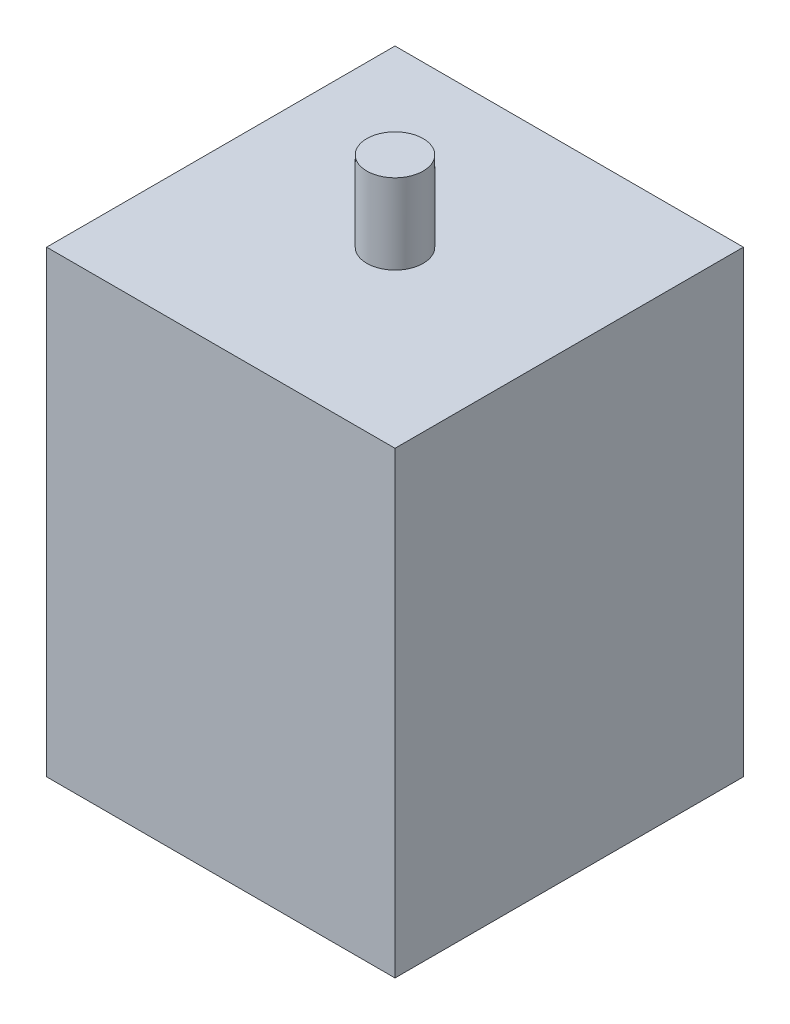
ISO-10303-21;
HEADER;
FILE_DESCRIPTION(('STEP AP214'),'2;1');
FILE_NAME('part.step','',(''),(''),'','','');
FILE_SCHEMA(('AUTOMOTIVE_DESIGN { 1 0 10303 214 1 1 1 1 }'));
ENDSEC;
DATA;
#1=APPLICATION_CONTEXT('core data for automotive mechanical design processes');
#2=APPLICATION_PROTOCOL_DEFINITION('international standard','automotive_design',2000,#1);
#3=PRODUCT_CONTEXT('',#1,'mechanical');
#4=PRODUCT('Part','Part','',(#3));
#5=PRODUCT_RELATED_PRODUCT_CATEGORY('part','',(#4));
#6=PRODUCT_DEFINITION_FORMATION('','',#4);
#7=PRODUCT_DEFINITION_CONTEXT('part definition',#1,'design');
#8=PRODUCT_DEFINITION('design','',#6,#7);
#9=PRODUCT_DEFINITION_SHAPE('','',#8);
#10=(LENGTH_UNIT() NAMED_UNIT(*) SI_UNIT(.MILLI.,.METRE.));
#11=(NAMED_UNIT(*) PLANE_ANGLE_UNIT() SI_UNIT($,.RADIAN.));
#12=(NAMED_UNIT(*) SI_UNIT($,.STERADIAN.) SOLID_ANGLE_UNIT());
#13=UNCERTAINTY_MEASURE_WITH_UNIT(LENGTH_MEASURE(1.E-05),#10,'distance_accuracy_value','');
#14=(GEOMETRIC_REPRESENTATION_CONTEXT(3) GLOBAL_UNCERTAINTY_ASSIGNED_CONTEXT((#13)) GLOBAL_UNIT_ASSIGNED_CONTEXT((#10,
#11,#12)) REPRESENTATION_CONTEXT('',''));
#15=CARTESIAN_POINT('',(0.,0.,0.));
#16=DIRECTION('',(0.,0.,1.));
#17=DIRECTION('',(1.,0.,0.));
#18=AXIS2_PLACEMENT_3D('',#15,#16,#17);
#19=CARTESIAN_POINT('',(0.,122.2,0.));
#20=DIRECTION('',(1.,0.,0.));
#21=DIRECTION('',(0.,0.,-1.));
#22=AXIS2_PLACEMENT_3D('',#19,#20,#21);
#23=PLANE('',#22);
#24=DIRECTION('',(0.,0.,1.));
#25=VECTOR('',#24,1.);
#26=CARTESIAN_POINT('',(0.,0.,0.));
#27=LINE('',#26,#25);
#28=CARTESIAN_POINT('',(0.,0.,-92.8));
#29=VERTEX_POINT('',#28);
#30=CARTESIAN_POINT('',(0.,0.,0.));
#31=VERTEX_POINT('',#30);
#32=EDGE_CURVE('E113',#29,#31,#27,.T.);
#33=ORIENTED_EDGE('',*,*,#32,.T.);
#34=DIRECTION('',(0.,-1.,0.));
#35=VECTOR('',#34,1.);
#36=CARTESIAN_POINT('',(0.,122.2,0.));
#37=LINE('',#36,#35);
#38=CARTESIAN_POINT('',(0.,122.2,0.));
#39=VERTEX_POINT('',#38);
#40=EDGE_CURVE('E55',#39,#31,#37,.T.);
#41=ORIENTED_EDGE('',*,*,#40,.F.);
#42=DIRECTION('',(0.,0.,1.));
#43=VECTOR('',#42,1.);
#44=CARTESIAN_POINT('',(0.,122.2,0.));
#45=LINE('',#44,#43);
#46=CARTESIAN_POINT('',(0.,122.2,-92.8));
#47=VERTEX_POINT('',#46);
#48=EDGE_CURVE('E99',#47,#39,#45,.T.);
#49=ORIENTED_EDGE('',*,*,#48,.F.);
#50=DIRECTION('',(0.,-1.,0.));
#51=VECTOR('',#50,1.);
#52=CARTESIAN_POINT('',(0.,122.2,-92.8));
#53=LINE('',#52,#51);
#54=EDGE_CURVE('E109',#47,#29,#53,.T.);
#55=ORIENTED_EDGE('',*,*,#54,.T.);
#56=EDGE_LOOP('',(#33,#41,#49,#55));
#57=FACE_BOUND('',#56,.T.);
#58=ADVANCED_FACE('F47',(#57),#23,.F.);
#59=CARTESIAN_POINT('',(0.,122.2,0.));
#60=DIRECTION('',(0.,0.,-1.));
#61=DIRECTION('',(-1.,0.,0.));
#62=AXIS2_PLACEMENT_3D('',#59,#60,#61);
#63=PLANE('',#62);
#64=DIRECTION('',(1.,0.,0.));
#65=VECTOR('',#64,1.);
#66=CARTESIAN_POINT('',(0.,0.,0.));
#67=LINE('',#66,#65);
#68=CARTESIAN_POINT('',(92.8,0.,0.));
#69=VERTEX_POINT('',#68);
#70=EDGE_CURVE('E104',#31,#69,#67,.T.);
#71=ORIENTED_EDGE('',*,*,#70,.T.);
#72=DIRECTION('',(0.,-1.,0.));
#73=VECTOR('',#72,1.);
#74=CARTESIAN_POINT('',(92.8,122.2,0.));
#75=LINE('',#74,#73);
#76=CARTESIAN_POINT('',(92.8,122.2,0.));
#77=VERTEX_POINT('',#76);
#78=EDGE_CURVE('E102',#77,#69,#75,.T.);
#79=ORIENTED_EDGE('',*,*,#78,.F.);
#80=DIRECTION('',(1.,0.,0.));
#81=VECTOR('',#80,1.);
#82=CARTESIAN_POINT('',(0.,122.2,0.));
#83=LINE('',#82,#81);
#84=EDGE_CURVE('E94',#39,#77,#83,.T.);
#85=ORIENTED_EDGE('',*,*,#84,.F.);
#86=ORIENTED_EDGE('',*,*,#40,.T.);
#87=EDGE_LOOP('',(#71,#79,#85,#86));
#88=FACE_BOUND('',#87,.T.);
#89=ADVANCED_FACE('F103',(#88),#63,.F.);
#90=CARTESIAN_POINT('',(92.8,122.2,0.));
#91=DIRECTION('',(-1.,0.,0.));
#92=DIRECTION('',(0.,0.,1.));
#93=AXIS2_PLACEMENT_3D('',#90,#91,#92);
#94=PLANE('',#93);
#95=DIRECTION('',(0.,0.,-1.));
#96=VECTOR('',#95,1.);
#97=CARTESIAN_POINT('',(92.8,0.,0.));
#98=LINE('',#97,#96);
#99=CARTESIAN_POINT('',(92.8,0.,-92.8));
#100=VERTEX_POINT('',#99);
#101=EDGE_CURVE('E80',#69,#100,#98,.T.);
#102=ORIENTED_EDGE('',*,*,#101,.T.);
#103=DIRECTION('',(0.,-1.,0.));
#104=VECTOR('',#103,1.);
#105=CARTESIAN_POINT('',(92.8,122.2,-92.8));
#106=LINE('',#105,#104);
#107=CARTESIAN_POINT('',(92.8,122.2,-92.8));
#108=VERTEX_POINT('',#107);
#109=EDGE_CURVE('E105',#108,#100,#106,.T.);
#110=ORIENTED_EDGE('',*,*,#109,.F.);
#111=DIRECTION('',(0.,0.,-1.));
#112=VECTOR('',#111,1.);
#113=CARTESIAN_POINT('',(92.8,122.2,0.));
#114=LINE('',#113,#112);
#115=EDGE_CURVE('E97',#77,#108,#114,.T.);
#116=ORIENTED_EDGE('',*,*,#115,.F.);
#117=ORIENTED_EDGE('',*,*,#78,.T.);
#118=EDGE_LOOP('',(#102,#110,#116,#117));
#119=FACE_BOUND('',#118,.T.);
#120=ADVANCED_FACE('F107',(#119),#94,.F.);
#121=CARTESIAN_POINT('',(0.,122.2,-92.8));
#122=DIRECTION('',(0.,0.,1.));
#123=DIRECTION('',(1.,0.,0.));
#124=AXIS2_PLACEMENT_3D('',#121,#122,#123);
#125=PLANE('',#124);
#126=DIRECTION('',(-1.,0.,0.));
#127=VECTOR('',#126,1.);
#128=CARTESIAN_POINT('',(0.,0.,-92.8));
#129=LINE('',#128,#127);
#130=EDGE_CURVE('E86',#100,#29,#129,.T.);
#131=ORIENTED_EDGE('',*,*,#130,.T.);
#132=ORIENTED_EDGE('',*,*,#54,.F.);
#133=DIRECTION('',(-1.,0.,0.));
#134=VECTOR('',#133,1.);
#135=CARTESIAN_POINT('',(0.,122.2,-92.8));
#136=LINE('',#135,#134);
#137=EDGE_CURVE('E63',#108,#47,#136,.T.);
#138=ORIENTED_EDGE('',*,*,#137,.F.);
#139=ORIENTED_EDGE('',*,*,#109,.T.);
#140=EDGE_LOOP('',(#131,#132,#138,#139));
#141=FACE_BOUND('',#140,.T.);
#142=ADVANCED_FACE('F136',(#141),#125,.F.);
#143=CARTESIAN_POINT('',(0.,122.2,0.));
#144=DIRECTION('',(0.,-1.,0.));
#145=DIRECTION('',(0.,0.,-1.));
#146=AXIS2_PLACEMENT_3D('',#143,#144,#145);
#147=PLANE('',#146);
#148=CARTESIAN_POINT('',(46.4,122.2,-46.4));
#149=DIRECTION('',(0.,-1.,0.));
#150=DIRECTION('',(0.,0.,-1.));
#151=AXIS2_PLACEMENT_3D('',#148,#149,#150);
#152=CIRCLE('',#151,7.5);
#153=CARTESIAN_POINT('',(46.4,122.2,-53.9));
#154=VERTEX_POINT('',#153);
#155=EDGE_CURVE('E11',#154,#154,#152,.F.);
#156=ORIENTED_EDGE('',*,*,#155,.F.);
#157=EDGE_LOOP('',(#156));
#158=FACE_BOUND('',#157,.T.);
#159=ORIENTED_EDGE('',*,*,#48,.T.);
#160=ORIENTED_EDGE('',*,*,#84,.T.);
#161=ORIENTED_EDGE('',*,*,#115,.T.);
#162=ORIENTED_EDGE('',*,*,#137,.T.);
#163=EDGE_LOOP('',(#159,#160,#161,#162));
#164=FACE_BOUND('',#163,.T.);
#165=ADVANCED_FACE('F95',(#158,#164),#147,.F.);
#166=CARTESIAN_POINT('',(0.,0.,0.));
#167=DIRECTION('',(0.,-1.,0.));
#168=DIRECTION('',(0.,0.,-1.));
#169=AXIS2_PLACEMENT_3D('',#166,#167,#168);
#170=PLANE('',#169);
#171=ORIENTED_EDGE('',*,*,#32,.F.);
#172=ORIENTED_EDGE('',*,*,#130,.F.);
#173=ORIENTED_EDGE('',*,*,#101,.F.);
#174=ORIENTED_EDGE('',*,*,#70,.F.);
#175=EDGE_LOOP('',(#171,#172,#173,#174));
#176=FACE_BOUND('',#175,.T.);
#177=ADVANCED_FACE('F124',(#176),#170,.T.);
#178=CARTESIAN_POINT('',(46.4,143.5,-46.4));
#179=DIRECTION('',(0.,-1.,0.));
#180=DIRECTION('',(0.,0.,-1.));
#181=AXIS2_PLACEMENT_3D('',#178,#179,#180);
#182=CYLINDRICAL_SURFACE('',#181,7.5);
#183=CARTESIAN_POINT('',(46.4,143.5,-46.4));
#184=DIRECTION('',(0.,1.,0.));
#185=DIRECTION('',(0.,0.,1.));
#186=AXIS2_PLACEMENT_3D('',#183,#184,#185);
#187=CIRCLE('',#186,7.5);
#188=CARTESIAN_POINT('',(46.4,143.5,-38.9));
#189=VERTEX_POINT('',#188);
#190=EDGE_CURVE('E116',#189,#189,#187,.T.);
#191=ORIENTED_EDGE('',*,*,#190,.F.);
#192=EDGE_LOOP('',(#191));
#193=FACE_BOUND('',#192,.T.);
#194=ORIENTED_EDGE('',*,*,#155,.T.);
#195=EDGE_LOOP('',(#194));
#196=FACE_BOUND('',#195,.T.);
#197=ADVANCED_FACE('F126',(#193,#196),#182,.T.);
#198=CARTESIAN_POINT('',(46.4,143.5,-46.4));
#199=DIRECTION('',(0.,1.,0.));
#200=DIRECTION('',(0.,0.,1.));
#201=AXIS2_PLACEMENT_3D('',#198,#199,#200);
#202=PLANE('',#201);
#203=ORIENTED_EDGE('',*,*,#190,.T.);
#204=EDGE_LOOP('',(#203));
#205=FACE_BOUND('',#204,.T.);
#206=ADVANCED_FACE('F133',(#205),#202,.T.);
#207=CLOSED_SHELL('',(#58,#89,#120,#142,#165,#177,#197,#206));
#208=MANIFOLD_SOLID_BREP('B2',#207);
#209=ADVANCED_BREP_SHAPE_REPRESENTATION('',(#18,#208),#14);
#210=SHAPE_DEFINITION_REPRESENTATION(#9,#209);
ENDSEC;
END-ISO-10303-21;
